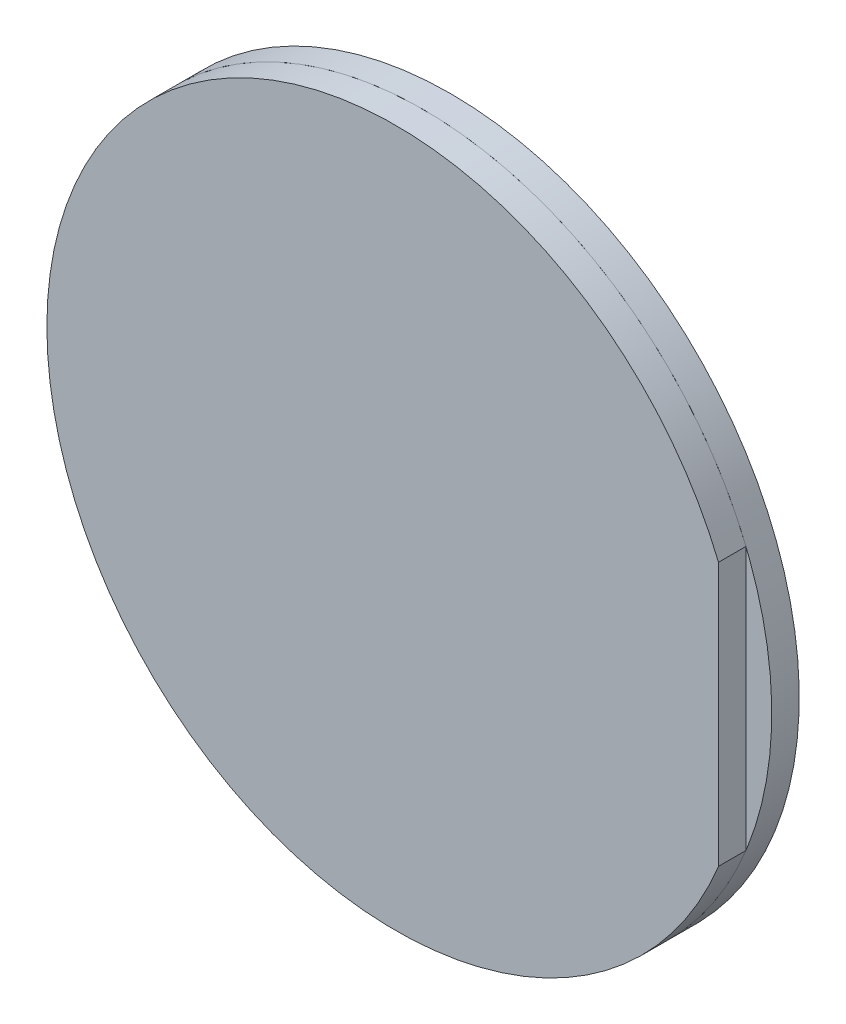
ISO-10303-21;
HEADER;
FILE_DESCRIPTION(('STEP AP214'),'2;1');
FILE_NAME('part.step','',(''),(''),'','','');
FILE_SCHEMA(('AUTOMOTIVE_DESIGN { 1 0 10303 214 1 1 1 1 }'));
ENDSEC;
DATA;
#1=APPLICATION_CONTEXT('core data for automotive mechanical design processes');
#2=APPLICATION_PROTOCOL_DEFINITION('international standard','automotive_design',2000,#1);
#3=PRODUCT_CONTEXT('',#1,'mechanical');
#4=PRODUCT('Part','Part','',(#3));
#5=PRODUCT_RELATED_PRODUCT_CATEGORY('part','',(#4));
#6=PRODUCT_DEFINITION_FORMATION('','',#4);
#7=PRODUCT_DEFINITION_CONTEXT('part definition',#1,'design');
#8=PRODUCT_DEFINITION('design','',#6,#7);
#9=PRODUCT_DEFINITION_SHAPE('','',#8);
#10=(LENGTH_UNIT() NAMED_UNIT(*) SI_UNIT(.MILLI.,.METRE.));
#11=(NAMED_UNIT(*) PLANE_ANGLE_UNIT() SI_UNIT($,.RADIAN.));
#12=(NAMED_UNIT(*) SI_UNIT($,.STERADIAN.) SOLID_ANGLE_UNIT());
#13=UNCERTAINTY_MEASURE_WITH_UNIT(LENGTH_MEASURE(1.E-05),#10,'distance_accuracy_value','');
#14=(GEOMETRIC_REPRESENTATION_CONTEXT(3) GLOBAL_UNCERTAINTY_ASSIGNED_CONTEXT((#13)) GLOBAL_UNIT_ASSIGNED_CONTEXT((#10,
#11,#12)) REPRESENTATION_CONTEXT('',''));
#15=CARTESIAN_POINT('',(0.,0.,0.));
#16=DIRECTION('',(0.,0.,1.));
#17=DIRECTION('',(1.,0.,0.));
#18=AXIS2_PLACEMENT_3D('',#15,#16,#17);
#19=CARTESIAN_POINT('',(12.1795756508242,-0.829902614356014,4.48618474318159));
#20=DIRECTION('',(0.,0.,-1.));
#21=DIRECTION('',(0.,-1.,0.));
#22=AXIS2_PLACEMENT_3D('',#19,#20,#21);
#23=CYLINDRICAL_SURFACE('',#22,6.35);
#24=CARTESIAN_POINT('',(12.1795756508242,-0.829902614356014,4.48618474318159));
#25=DIRECTION('',(0.,0.,1.));
#26=DIRECTION('',(0.,1.,0.));
#27=AXIS2_PLACEMENT_3D('',#24,#25,#26);
#28=CIRCLE('',#27,6.35);
#29=CARTESIAN_POINT('',(18.0595756508242,1.56761693718053,4.48618474318159));
#30=VERTEX_POINT('',#29);
#31=CARTESIAN_POINT('',(18.0595756508242,-3.22742216589256,4.48618474318159));
#32=VERTEX_POINT('',#31);
#33=EDGE_CURVE('P0_E23',#30,#32,#28,.T.);
#34=ORIENTED_EDGE('',*,*,#33,.F.);
#35=DIRECTION('',(0.,0.,-1.));
#36=VECTOR('',#35,1.);
#37=CARTESIAN_POINT('',(18.0595756508242,1.56761693718053,4.48618474318159));
#38=LINE('',#37,#36);
#39=CARTESIAN_POINT('',(18.0595756508242,1.56761693718053,3.98618474318159));
#40=VERTEX_POINT('',#39);
#41=EDGE_CURVE('P0_E37',#30,#40,#38,.T.);
#42=ORIENTED_EDGE('',*,*,#41,.T.);
#43=CARTESIAN_POINT('',(12.1795756508242,-0.829902614356014,3.98618474318159));
#44=DIRECTION('',(0.,0.,1.));
#45=DIRECTION('',(0.,1.,0.));
#46=AXIS2_PLACEMENT_3D('',#43,#44,#45);
#47=CIRCLE('',#46,6.35);
#48=CARTESIAN_POINT('',(18.0595756508242,-3.22742216589256,3.98618474318159));
#49=VERTEX_POINT('',#48);
#50=EDGE_CURVE('P0_E45',#40,#49,#47,.T.);
#51=ORIENTED_EDGE('',*,*,#50,.T.);
#52=DIRECTION('',(0.,0.,-1.));
#53=VECTOR('',#52,1.);
#54=CARTESIAN_POINT('',(18.0595756508242,-3.22742216589256,4.48618474318159));
#55=LINE('',#54,#53);
#56=EDGE_CURVE('P0_E30',#49,#32,#55,.F.);
#57=ORIENTED_EDGE('',*,*,#56,.T.);
#58=EDGE_LOOP('',(#34,#42,#51,#57));
#59=FACE_BOUND('',#58,.T.);
#60=ADVANCED_FACE('P0_F16',(#59),#23,.T.);
#61=CARTESIAN_POINT('',(12.1795756508242,-0.829902614356014,4.48618474318159));
#62=DIRECTION('',(0.,0.,1.));
#63=DIRECTION('',(0.,1.,0.));
#64=AXIS2_PLACEMENT_3D('',#61,#62,#63);
#65=PLANE('',#64);
#66=DIRECTION('',(0.,-1.,0.));
#67=VECTOR('',#66,1.);
#68=CARTESIAN_POINT('',(18.0595756508242,-6.71724068804703,4.48618474318159));
#69=LINE('',#68,#67);
#70=EDGE_CURVE('P0_E40',#30,#32,#69,.T.);
#71=ORIENTED_EDGE('',*,*,#70,.F.);
#72=ORIENTED_EDGE('',*,*,#33,.T.);
#73=EDGE_LOOP('',(#71,#72));
#74=FACE_BOUND('',#73,.T.);
#75=ADVANCED_FACE('P0_F49',(#74),#65,.T.);
#76=CARTESIAN_POINT('',(12.1795756508242,-0.829902614356014,3.98618474318159));
#77=DIRECTION('',(0.,0.,1.));
#78=DIRECTION('',(0.,1.,0.));
#79=AXIS2_PLACEMENT_3D('',#76,#77,#78);
#80=PLANE('',#79);
#81=ORIENTED_EDGE('',*,*,#50,.F.);
#82=DIRECTION('',(0.,-1.,0.));
#83=VECTOR('',#82,1.);
#84=CARTESIAN_POINT('',(18.0595756508242,-0.829902614356015,3.98618474318159));
#85=LINE('',#84,#83);
#86=EDGE_CURVE('P0_E10',#40,#49,#85,.T.);
#87=ORIENTED_EDGE('',*,*,#86,.T.);
#88=EDGE_LOOP('',(#81,#87));
#89=FACE_BOUND('',#88,.T.);
#90=ADVANCED_FACE('P0_F54',(#89),#80,.F.);
#91=CARTESIAN_POINT('',(18.0595756508242,-6.71724068804703,3.98618474318159));
#92=DIRECTION('',(-1.,0.,0.));
#93=DIRECTION('',(0.,0.,1.));
#94=AXIS2_PLACEMENT_3D('',#91,#92,#93);
#95=PLANE('',#94);
#96=ORIENTED_EDGE('',*,*,#70,.T.);
#97=ORIENTED_EDGE('',*,*,#56,.F.);
#98=ORIENTED_EDGE('',*,*,#86,.F.);
#99=ORIENTED_EDGE('',*,*,#41,.F.);
#100=EDGE_LOOP('',(#96,#97,#98,#99));
#101=FACE_BOUND('',#100,.T.);
#102=ADVANCED_FACE('P0_F39',(#101),#95,.F.);
#103=CLOSED_SHELL('',(#60,#75,#90,#102));
#104=MANIFOLD_SOLID_BREP('P0_B1',#103);
#105=CARTESIAN_POINT('',(12.1795756508242,-0.829902614356014,3.98618474318159));
#106=DIRECTION('',(0.,0.,-1.));
#107=DIRECTION('',(-1.,0.,0.));
#108=AXIS2_PLACEMENT_3D('',#105,#106,#107);
#109=CYLINDRICAL_SURFACE('',#108,6.35);
#110=CARTESIAN_POINT('',(12.1795756508242,-0.829902614356014,3.98618474318159));
#111=DIRECTION('',(0.,0.,1.));
#112=DIRECTION('',(1.,0.,0.));
#113=AXIS2_PLACEMENT_3D('',#110,#111,#112);
#114=CIRCLE('',#113,6.35);
#115=CARTESIAN_POINT('',(14.5770952023607,-6.70990261435601,3.98618474318159));
#116=VERTEX_POINT('',#115);
#117=CARTESIAN_POINT('',(9.78205609928763,-6.70990261435601,3.98618474318159));
#118=VERTEX_POINT('',#117);
#119=EDGE_CURVE('P1_E24',#116,#118,#114,.T.);
#120=ORIENTED_EDGE('',*,*,#119,.F.);
#121=DIRECTION('',(0.,0.,-1.));
#122=VECTOR('',#121,1.);
#123=CARTESIAN_POINT('',(14.5770952023607,-6.70990261435601,3.98618474318159));
#124=LINE('',#123,#122);
#125=CARTESIAN_POINT('',(14.5770952023607,-6.70990261435601,3.48618474318159));
#126=VERTEX_POINT('',#125);
#127=EDGE_CURVE('P1_E38',#116,#126,#124,.T.);
#128=ORIENTED_EDGE('',*,*,#127,.T.);
#129=CARTESIAN_POINT('',(12.1795756508242,-0.829902614356014,3.48618474318159));
#130=DIRECTION('',(0.,0.,1.));
#131=DIRECTION('',(1.,0.,0.));
#132=AXIS2_PLACEMENT_3D('',#129,#130,#131);
#133=CIRCLE('',#132,6.35);
#134=CARTESIAN_POINT('',(9.78205609928763,-6.70990261435601,3.48618474318159));
#135=VERTEX_POINT('',#134);
#136=EDGE_CURVE('P1_E46',#126,#135,#133,.T.);
#137=ORIENTED_EDGE('',*,*,#136,.T.);
#138=DIRECTION('',(0.,0.,-1.));
#139=VECTOR('',#138,1.);
#140=CARTESIAN_POINT('',(9.78205609928763,-6.70990261435601,3.98618474318159));
#141=LINE('',#140,#139);
#142=EDGE_CURVE('P1_E31',#135,#118,#141,.F.);
#143=ORIENTED_EDGE('',*,*,#142,.T.);
#144=EDGE_LOOP('',(#120,#128,#137,#143));
#145=FACE_BOUND('',#144,.T.);
#146=ADVANCED_FACE('P1_F17',(#145),#109,.T.);
#147=CARTESIAN_POINT('',(12.1795756508242,-0.829902614356014,3.98618474318159));
#148=DIRECTION('',(0.,0.,1.));
#149=DIRECTION('',(1.,0.,0.));
#150=AXIS2_PLACEMENT_3D('',#147,#148,#149);
#151=PLANE('',#150);
#152=DIRECTION('',(-1.,0.,0.));
#153=VECTOR('',#152,1.);
#154=CARTESIAN_POINT('',(6.29223757713317,-6.70990261435601,3.98618474318159));
#155=LINE('',#154,#153);
#156=EDGE_CURVE('P1_E41',#116,#118,#155,.T.);
#157=ORIENTED_EDGE('',*,*,#156,.F.);
#158=ORIENTED_EDGE('',*,*,#119,.T.);
#159=EDGE_LOOP('',(#157,#158));
#160=FACE_BOUND('',#159,.T.);
#161=ADVANCED_FACE('P1_F50',(#160),#151,.T.);
#162=CARTESIAN_POINT('',(12.1795756508242,-0.829902614356014,3.48618474318159));
#163=DIRECTION('',(0.,0.,1.));
#164=DIRECTION('',(1.,0.,0.));
#165=AXIS2_PLACEMENT_3D('',#162,#163,#164);
#166=PLANE('',#165);
#167=ORIENTED_EDGE('',*,*,#136,.F.);
#168=DIRECTION('',(-1.,0.,0.));
#169=VECTOR('',#168,1.);
#170=CARTESIAN_POINT('',(12.1795756508242,-6.70990261435601,3.48618474318159));
#171=LINE('',#170,#169);
#172=EDGE_CURVE('P1_E11',#126,#135,#171,.T.);
#173=ORIENTED_EDGE('',*,*,#172,.T.);
#174=EDGE_LOOP('',(#167,#173));
#175=FACE_BOUND('',#174,.T.);
#176=ADVANCED_FACE('P1_F55',(#175),#166,.F.);
#177=CARTESIAN_POINT('',(6.29223757713317,-6.70990261435601,3.48618474318159));
#178=DIRECTION('',(0.,1.,0.));
#179=DIRECTION('',(0.,0.,1.));
#180=AXIS2_PLACEMENT_3D('',#177,#178,#179);
#181=PLANE('',#180);
#182=ORIENTED_EDGE('',*,*,#156,.T.);
#183=ORIENTED_EDGE('',*,*,#142,.F.);
#184=ORIENTED_EDGE('',*,*,#172,.F.);
#185=ORIENTED_EDGE('',*,*,#127,.F.);
#186=EDGE_LOOP('',(#182,#183,#184,#185));
#187=FACE_BOUND('',#186,.T.);
#188=ADVANCED_FACE('P1_F40',(#187),#181,.F.);
#189=CLOSED_SHELL('',(#146,#161,#176,#188));
#190=MANIFOLD_SOLID_BREP('P1_B1',#189);
#191=ADVANCED_BREP_SHAPE_REPRESENTATION('',(#18,#104,#190),#14);
#192=SHAPE_DEFINITION_REPRESENTATION(#9,#191);
ENDSEC;
END-ISO-10303-21;
